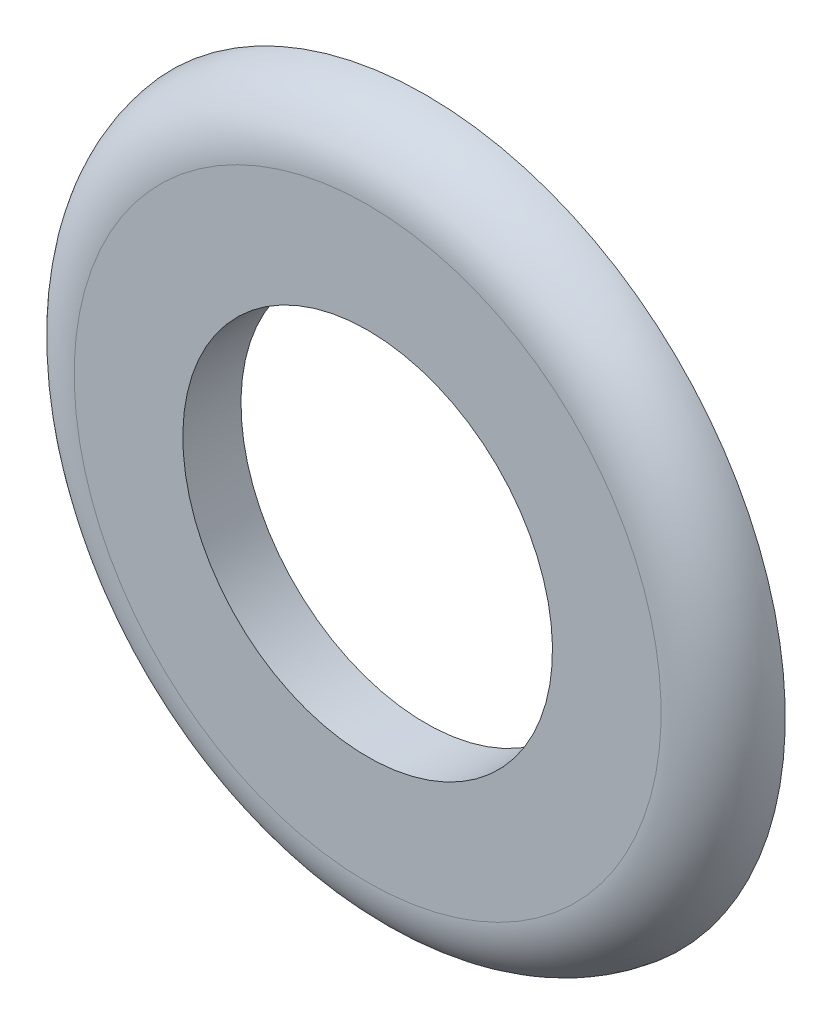
ISO-10303-21;
HEADER;
FILE_DESCRIPTION(('STEP AP214'),'2;1');
FILE_NAME('part.step','',(''),(''),'','','');
FILE_SCHEMA(('AUTOMOTIVE_DESIGN { 1 0 10303 214 1 1 1 1 }'));
ENDSEC;
DATA;
#1=APPLICATION_CONTEXT('core data for automotive mechanical design processes');
#2=APPLICATION_PROTOCOL_DEFINITION('international standard','automotive_design',2000,#1);
#3=PRODUCT_CONTEXT('',#1,'mechanical');
#4=PRODUCT('Part','Part','',(#3));
#5=PRODUCT_RELATED_PRODUCT_CATEGORY('part','',(#4));
#6=PRODUCT_DEFINITION_FORMATION('','',#4);
#7=PRODUCT_DEFINITION_CONTEXT('part definition',#1,'design');
#8=PRODUCT_DEFINITION('design','',#6,#7);
#9=PRODUCT_DEFINITION_SHAPE('','',#8);
#10=(LENGTH_UNIT() NAMED_UNIT(*) SI_UNIT(.MILLI.,.METRE.));
#11=(NAMED_UNIT(*) PLANE_ANGLE_UNIT() SI_UNIT($,.RADIAN.));
#12=(NAMED_UNIT(*) SI_UNIT($,.STERADIAN.) SOLID_ANGLE_UNIT());
#13=UNCERTAINTY_MEASURE_WITH_UNIT(LENGTH_MEASURE(1.E-05),#10,'distance_accuracy_value','');
#14=(GEOMETRIC_REPRESENTATION_CONTEXT(3) GLOBAL_UNCERTAINTY_ASSIGNED_CONTEXT((#13)) GLOBAL_UNIT_ASSIGNED_CONTEXT((#10,
#11,#12)) REPRESENTATION_CONTEXT('',''));
#15=CARTESIAN_POINT('',(0.,0.,0.));
#16=DIRECTION('',(0.,0.,1.));
#17=DIRECTION('',(1.,0.,0.));
#18=AXIS2_PLACEMENT_3D('',#15,#16,#17);
#19=CARTESIAN_POINT('',(0.,2.66666666666667,4.77139999999999));
#20=DIRECTION('',(0.,0.,1.));
#21=DIRECTION('',(0.,-1.,0.));
#22=AXIS2_PLACEMENT_3D('',#19,#20,#21);
#23=PLANE('',#22);
#24=CARTESIAN_POINT('',(0.,0.,4.77139999999999));
#25=DIRECTION('',(0.,0.,-1.));
#26=DIRECTION('',(0.,1.,0.));
#27=AXIS2_PLACEMENT_3D('',#24,#25,#26);
#28=CIRCLE('',#27,1.67957711057353);
#29=CARTESIAN_POINT('',(0.,1.67957711057353,4.77139999999999));
#30=VERTEX_POINT('',#29);
#31=EDGE_CURVE('E21',#30,#30,#28,.T.);
#32=ORIENTED_EDGE('',*,*,#31,.T.);
#33=EDGE_LOOP('',(#32));
#34=FACE_BOUND('',#33,.T.);
#35=CARTESIAN_POINT('',(0.,0.,4.7714));
#36=DIRECTION('',(0.,0.,-1.));
#37=DIRECTION('',(0.,1.,0.));
#38=AXIS2_PLACEMENT_3D('',#35,#36,#37);
#39=CIRCLE('',#38,2.66666666666667);
#40=CARTESIAN_POINT('',(0.,2.66666666666667,4.77139999999999));
#41=VERTEX_POINT('',#40);
#42=CARTESIAN_POINT('',(0.,-2.66666666666667,4.77139999999999));
#43=VERTEX_POINT('',#42);
#44=EDGE_CURVE('E33',#41,#43,#39,.T.);
#45=ORIENTED_EDGE('',*,*,#44,.F.);
#46=CARTESIAN_POINT('',(0.,0.,4.7714));
#47=DIRECTION('',(0.,0.,-1.));
#48=DIRECTION('',(0.,-1.,0.));
#49=AXIS2_PLACEMENT_3D('',#46,#47,#48);
#50=CIRCLE('',#49,2.66666666666667);
#51=EDGE_CURVE('E36',#43,#41,#50,.T.);
#52=ORIENTED_EDGE('',*,*,#51,.F.);
#53=EDGE_LOOP('',(#45,#52));
#54=FACE_BOUND('',#53,.T.);
#55=ADVANCED_FACE('F17',(#34,#54),#23,.T.);
#56=CARTESIAN_POINT('',(0.,0.,4.16666666666666));
#57=DIRECTION('',(0.,0.,-1.));
#58=DIRECTION('',(0.,1.,0.));
#59=AXIS2_PLACEMENT_3D('',#56,#57,#58);
#60=TOROIDAL_SURFACE('',#59,2.66666666666667,0.604733333333332);
#61=ORIENTED_EDGE('',*,*,#44,.T.);
#62=ORIENTED_EDGE('',*,*,#51,.T.);
#63=EDGE_LOOP('',(#61,#62));
#64=FACE_BOUND('',#63,.T.);
#65=CARTESIAN_POINT('',(0.,0.,4.24286666666666));
#66=DIRECTION('',(0.,0.,-1.));
#67=DIRECTION('',(0.,1.,0.));
#68=AXIS2_PLACEMENT_3D('',#65,#66,#67);
#69=CIRCLE('',#68,3.26657996410593);
#70=CARTESIAN_POINT('',(0.,3.26657996410592,4.24286666666666));
#71=VERTEX_POINT('',#70);
#72=EDGE_CURVE('E27',#71,#71,#69,.T.);
#73=ORIENTED_EDGE('',*,*,#72,.F.);
#74=EDGE_LOOP('',(#73));
#75=FACE_BOUND('',#74,.T.);
#76=ADVANCED_FACE('F43',(#64,#75),#60,.T.);
#77=CARTESIAN_POINT('',(0.,0.,4.24286666666666));
#78=DIRECTION('',(0.,0.,-1.));
#79=DIRECTION('',(0.,1.,0.));
#80=AXIS2_PLACEMENT_3D('',#77,#78,#79);
#81=CYLINDRICAL_SURFACE('',#80,1.67957711057353);
#82=CARTESIAN_POINT('',(0.,0.,4.24286666666666));
#83=DIRECTION('',(0.,0.,-1.));
#84=DIRECTION('',(0.,1.,0.));
#85=AXIS2_PLACEMENT_3D('',#82,#83,#84);
#86=CIRCLE('',#85,1.67957711057353);
#87=CARTESIAN_POINT('',(0.,1.67957711057353,4.24286666666666));
#88=VERTEX_POINT('',#87);
#89=EDGE_CURVE('E11',#88,#88,#86,.F.);
#90=ORIENTED_EDGE('',*,*,#89,.F.);
#91=EDGE_LOOP('',(#90));
#92=FACE_BOUND('',#91,.T.);
#93=ORIENTED_EDGE('',*,*,#31,.F.);
#94=EDGE_LOOP('',(#93));
#95=FACE_BOUND('',#94,.T.);
#96=ADVANCED_FACE('F60',(#92,#95),#81,.F.);
#97=CARTESIAN_POINT('',(0.,1.67957711057353,4.24286666666666));
#98=DIRECTION('',(0.,0.,-1.));
#99=DIRECTION('',(0.,1.,0.));
#100=AXIS2_PLACEMENT_3D('',#97,#98,#99);
#101=PLANE('',#100);
#102=ORIENTED_EDGE('',*,*,#89,.T.);
#103=EDGE_LOOP('',(#102));
#104=FACE_BOUND('',#103,.T.);
#105=ORIENTED_EDGE('',*,*,#72,.T.);
#106=EDGE_LOOP('',(#105));
#107=FACE_BOUND('',#106,.T.);
#108=ADVANCED_FACE('F86',(#104,#107),#101,.T.);
#109=CLOSED_SHELL('',(#55,#76,#96,#108));
#110=MANIFOLD_SOLID_BREP('B1',#109);
#111=ADVANCED_BREP_SHAPE_REPRESENTATION('',(#18,#110),#14);
#112=SHAPE_DEFINITION_REPRESENTATION(#9,#111);
ENDSEC;
END-ISO-10303-21;
